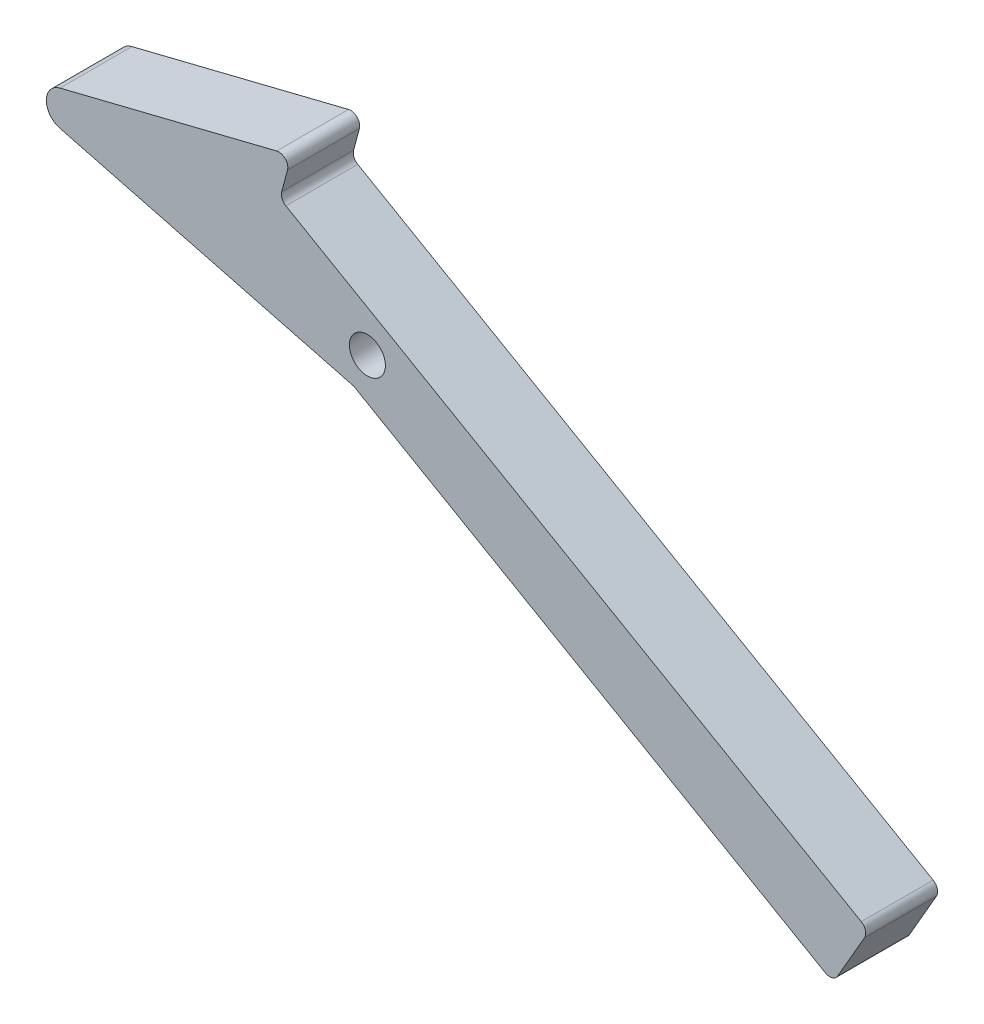
ISO-10303-21;
HEADER;
FILE_DESCRIPTION(('STEP AP214'),'2;1');
FILE_NAME('part.step','',(''),(''),'','','');
FILE_SCHEMA(('AUTOMOTIVE_DESIGN { 1 0 10303 214 1 1 1 1 }'));
ENDSEC;
DATA;
#1=APPLICATION_CONTEXT('core data for automotive mechanical design processes');
#2=APPLICATION_PROTOCOL_DEFINITION('international standard','automotive_design',2000,#1);
#3=PRODUCT_CONTEXT('',#1,'mechanical');
#4=PRODUCT('Part','Part','',(#3));
#5=PRODUCT_RELATED_PRODUCT_CATEGORY('part','',(#4));
#6=PRODUCT_DEFINITION_FORMATION('','',#4);
#7=PRODUCT_DEFINITION_CONTEXT('part definition',#1,'design');
#8=PRODUCT_DEFINITION('design','',#6,#7);
#9=PRODUCT_DEFINITION_SHAPE('','',#8);
#10=(LENGTH_UNIT() NAMED_UNIT(*) SI_UNIT(.MILLI.,.METRE.));
#11=(NAMED_UNIT(*) PLANE_ANGLE_UNIT() SI_UNIT($,.RADIAN.));
#12=(NAMED_UNIT(*) SI_UNIT($,.STERADIAN.) SOLID_ANGLE_UNIT());
#13=UNCERTAINTY_MEASURE_WITH_UNIT(LENGTH_MEASURE(1.E-05),#10,'distance_accuracy_value','');
#14=(GEOMETRIC_REPRESENTATION_CONTEXT(3) GLOBAL_UNCERTAINTY_ASSIGNED_CONTEXT((#13)) GLOBAL_UNIT_ASSIGNED_CONTEXT((#10,
#11,#12)) REPRESENTATION_CONTEXT('',''));
#15=CARTESIAN_POINT('',(0.,0.,0.));
#16=DIRECTION('',(0.,0.,1.));
#17=DIRECTION('',(1.,0.,0.));
#18=AXIS2_PLACEMENT_3D('',#15,#16,#17);
#19=CARTESIAN_POINT('',(1.58749999999999,2.7496306570156,-3.175));
#20=DIRECTION('',(-0.499999999999998,-0.86602540378444,0.));
#21=DIRECTION('',(0.86602540378444,-0.499999999999998,0.));
#22=AXIS2_PLACEMENT_3D('',#19,#20,#21);
#23=PLANE('',#22);
#24=DIRECTION('',(0.86602540378444,-0.499999999999998,0.));
#25=VECTOR('',#24,1.);
#26=CARTESIAN_POINT('',(1.58749999999999,2.7496306570156,3.175));
#27=LINE('',#26,#25);
#28=CARTESIAN_POINT('',(-7.20064251139426,7.82346710164583,3.175));
#29=VERTEX_POINT('',#28);
#30=CARTESIAN_POINT('',(43.6054846420932,-21.5094640869023,3.175));
#31=VERTEX_POINT('',#30);
#32=EDGE_CURVE('E216',#29,#31,#27,.T.);
#33=ORIENTED_EDGE('',*,*,#32,.T.);
#34=DIRECTION('',(0.,0.,1.));
#35=VECTOR('',#34,1.);
#36=CARTESIAN_POINT('',(43.6054846420932,-21.5094640869023,-3.175));
#37=LINE('',#36,#35);
#38=CARTESIAN_POINT('',(43.6054846420932,-21.5094640869023,-3.175));
#39=VERTEX_POINT('',#38);
#40=EDGE_CURVE('E199',#31,#39,#37,.F.);
#41=ORIENTED_EDGE('',*,*,#40,.T.);
#42=DIRECTION('',(0.86602540378444,-0.499999999999998,0.));
#43=VECTOR('',#42,1.);
#44=CARTESIAN_POINT('',(1.58749999999999,2.7496306570156,-3.175));
#45=LINE('',#44,#43);
#46=CARTESIAN_POINT('',(-7.20064251139426,7.82346710164583,-3.175));
#47=VERTEX_POINT('',#46);
#48=EDGE_CURVE('E164',#47,#39,#45,.T.);
#49=ORIENTED_EDGE('',*,*,#48,.F.);
#50=DIRECTION('',(0.,0.,1.));
#51=VECTOR('',#50,1.);
#52=CARTESIAN_POINT('',(-7.20064251139426,7.82346710164583,-3.175));
#53=LINE('',#52,#51);
#54=EDGE_CURVE('E196',#47,#29,#53,.T.);
#55=ORIENTED_EDGE('',*,*,#54,.T.);
#56=EDGE_LOOP('',(#33,#41,#49,#55));
#57=FACE_BOUND('',#56,.T.);
#58=ADVANCED_FACE('F41',(#57),#23,.F.);
#59=CARTESIAN_POINT('',(42.7053923063471,-24.6559697439179,-3.175));
#60=DIRECTION('',(-0.86602540378444,0.499999999999998,0.));
#61=DIRECTION('',(-0.499999999999998,-0.86602540378444,0.));
#62=AXIS2_PLACEMENT_3D('',#59,#60,#61);
#63=PLANE('',#62);
#64=DIRECTION('',(-0.499999999999998,-0.86602540378444,0.));
#65=VECTOR('',#64,1.);
#66=CARTESIAN_POINT('',(42.7053923063471,-24.6559697439179,-3.175));
#67=LINE('',#66,#65);
#68=CARTESIAN_POINT('',(43.8960173063471,-22.5937467511562,-3.175));
#69=VERTEX_POINT('',#68);
#70=CARTESIAN_POINT('',(41.5147673063471,-26.7181927366796,-3.175));
#71=VERTEX_POINT('',#70);
#72=EDGE_CURVE('E177',#69,#71,#67,.T.);
#73=ORIENTED_EDGE('',*,*,#72,.F.);
#74=DIRECTION('',(0.,0.,1.));
#75=VECTOR('',#74,1.);
#76=CARTESIAN_POINT('',(43.8960173063471,-22.5937467511562,-3.175));
#77=LINE('',#76,#75);
#78=CARTESIAN_POINT('',(43.8960173063471,-22.5937467511562,3.175));
#79=VERTEX_POINT('',#78);
#80=EDGE_CURVE('E188',#69,#79,#77,.T.);
#81=ORIENTED_EDGE('',*,*,#80,.T.);
#82=DIRECTION('',(-0.499999999999998,-0.86602540378444,0.));
#83=VECTOR('',#82,1.);
#84=CARTESIAN_POINT('',(42.7053923063471,-24.6559697439179,3.175));
#85=LINE('',#84,#83);
#86=CARTESIAN_POINT('',(41.5147673063471,-26.7181927366796,3.175));
#87=VERTEX_POINT('',#86);
#88=EDGE_CURVE('E158',#79,#87,#85,.T.);
#89=ORIENTED_EDGE('',*,*,#88,.T.);
#90=DIRECTION('',(0.,0.,1.));
#91=VECTOR('',#90,1.);
#92=CARTESIAN_POINT('',(41.5147673063471,-26.7181927366796,-3.175));
#93=LINE('',#92,#91);
#94=EDGE_CURVE('E185',#87,#71,#93,.F.);
#95=ORIENTED_EDGE('',*,*,#94,.T.);
#96=EDGE_LOOP('',(#73,#81,#89,#95));
#97=FACE_BOUND('',#96,.T.);
#98=ADVANCED_FACE('F235',(#97),#63,.F.);
#99=CARTESIAN_POINT('',(-1.58749999999999,-2.74963065701558,-3.175));
#100=DIRECTION('',(0.499999999999998,0.866025403784439,0.));
#101=DIRECTION('',(-0.86602540378444,0.499999999999998,0.));
#102=AXIS2_PLACEMENT_3D('',#99,#100,#101);
#103=PLANE('',#102);
#104=DIRECTION('',(-0.86602540378444,0.499999999999998,0.));
#105=VECTOR('',#104,1.);
#106=CARTESIAN_POINT('',(-1.58749999999999,-2.74963065701558,-3.175));
#107=LINE('',#106,#105);
#108=CARTESIAN_POINT('',(40.4304846420932,-27.0087254009335,-3.175));
#109=VERTEX_POINT('',#108);
#110=CARTESIAN_POINT('',(-1.21507831394484,-2.96464841771157,-3.175));
#111=VERTEX_POINT('',#110);
#112=EDGE_CURVE('E175',#109,#111,#107,.T.);
#113=ORIENTED_EDGE('',*,*,#112,.F.);
#114=DIRECTION('',(0.,0.,1.));
#115=VECTOR('',#114,1.);
#116=CARTESIAN_POINT('',(40.4304846420932,-27.0087254009335,-3.175));
#117=LINE('',#116,#115);
#118=CARTESIAN_POINT('',(40.4304846420932,-27.0087254009335,3.175));
#119=VERTEX_POINT('',#118);
#120=EDGE_CURVE('E206',#109,#119,#117,.T.);
#121=ORIENTED_EDGE('',*,*,#120,.T.);
#122=DIRECTION('',(-0.86602540378444,0.499999999999998,0.));
#123=VECTOR('',#122,1.);
#124=CARTESIAN_POINT('',(-1.58749999999999,-2.74963065701558,3.175));
#125=LINE('',#124,#123);
#126=CARTESIAN_POINT('',(-1.21507831394484,-2.96464841771157,3.175));
#127=VERTEX_POINT('',#126);
#128=EDGE_CURVE('E153',#119,#127,#125,.T.);
#129=ORIENTED_EDGE('',*,*,#128,.T.);
#130=DIRECTION('',(0.,0.,1.));
#131=VECTOR('',#130,1.);
#132=CARTESIAN_POINT('',(-1.21507831394484,-2.96464841771157,-3.175));
#133=LINE('',#132,#131);
#134=EDGE_CURVE('E182',#111,#127,#133,.T.);
#135=ORIENTED_EDGE('',*,*,#134,.F.);
#136=EDGE_LOOP('',(#113,#121,#129,#135));
#137=FACE_BOUND('',#136,.T.);
#138=ADVANCED_FACE('F244',(#137),#103,.F.);
#139=CARTESIAN_POINT('',(-0.79887816906418,-3.07285187911696,-3.175));
#140=DIRECTION('',(-0.251615171358797,-0.967827363501406,0.));
#141=DIRECTION('',(0.967827363501406,-0.251615171358797,0.));
#142=AXIS2_PLACEMENT_3D('',#139,#140,#141);
#143=PLANE('',#142);
#144=ORIENTED_EDGE('',*,*,#134,.T.);
#145=DIRECTION('',(0.967827363501406,-0.251615171358797,0.));
#146=VECTOR('',#145,1.);
#147=CARTESIAN_POINT('',(-0.79887816906418,-3.07285187911696,3.175));
#148=LINE('',#147,#146);
#149=CARTESIAN_POINT('',(-27.1617476790787,3.7809509574488,3.175));
#150=VERTEX_POINT('',#149);
#151=EDGE_CURVE('E151',#150,#127,#148,.T.);
#152=ORIENTED_EDGE('',*,*,#151,.F.);
#153=DIRECTION('',(0.,0.,1.));
#154=VECTOR('',#153,1.);
#155=CARTESIAN_POINT('',(-27.1617476790787,3.7809509574488,-3.175));
#156=LINE('',#155,#154);
#157=CARTESIAN_POINT('',(-27.1617476790787,3.7809509574488,-3.175));
#158=VERTEX_POINT('',#157);
#159=EDGE_CURVE('E147',#158,#150,#156,.T.);
#160=ORIENTED_EDGE('',*,*,#159,.F.);
#161=DIRECTION('',(0.967827363501406,-0.251615171358797,0.));
#162=VECTOR('',#161,1.);
#163=CARTESIAN_POINT('',(-0.79887816906418,-3.07285187911696,-3.175));
#164=LINE('',#163,#162);
#165=EDGE_CURVE('E172',#158,#111,#164,.T.);
#166=ORIENTED_EDGE('',*,*,#165,.T.);
#167=EDGE_LOOP('',(#144,#152,#160,#166));
#168=FACE_BOUND('',#167,.T.);
#169=ADVANCED_FACE('F247',(#168),#143,.T.);
#170=CARTESIAN_POINT('',(-26.7623085945466,5.31737689700728,-3.175));
#171=DIRECTION('',(0.,0.,1.));
#172=DIRECTION('',(1.,0.,0.));
#173=AXIS2_PLACEMENT_3D('',#170,#171,#172);
#174=CYLINDRICAL_SURFACE('',#173,1.5875);
#175=ORIENTED_EDGE('',*,*,#159,.T.);
#176=CARTESIAN_POINT('',(-26.7623085945466,5.31737689700728,3.175));
#177=DIRECTION('',(0.,0.,1.));
#178=DIRECTION('',(1.,0.,0.));
#179=AXIS2_PLACEMENT_3D('',#176,#177,#178);
#180=CIRCLE('',#179,1.5875);
#181=CARTESIAN_POINT('',(-27.1452403176058,6.858,3.175));
#182=VERTEX_POINT('',#181);
#183=EDGE_CURVE('E132',#182,#150,#180,.T.);
#184=ORIENTED_EDGE('',*,*,#183,.F.);
#185=DIRECTION('',(0.,0.,1.));
#186=VECTOR('',#185,1.);
#187=CARTESIAN_POINT('',(-27.1452403176058,6.858,-3.175));
#188=LINE('',#187,#186);
#189=CARTESIAN_POINT('',(-27.1452403176058,6.858,-3.175));
#190=VERTEX_POINT('',#189);
#191=EDGE_CURVE('E141',#190,#182,#188,.T.);
#192=ORIENTED_EDGE('',*,*,#191,.F.);
#193=CARTESIAN_POINT('',(-26.7623085945466,5.31737689700728,-3.175));
#194=DIRECTION('',(0.,0.,1.));
#195=DIRECTION('',(1.,0.,0.));
#196=AXIS2_PLACEMENT_3D('',#193,#194,#195);
#197=CIRCLE('',#196,1.5875);
#198=EDGE_CURVE('E170',#190,#158,#197,.T.);
#199=ORIENTED_EDGE('',*,*,#198,.T.);
#200=EDGE_LOOP('',(#175,#184,#192,#199));
#201=FACE_BOUND('',#200,.T.);
#202=ADVANCED_FACE('F150',(#201),#174,.T.);
#203=CARTESIAN_POINT('',(-3.18487768699857,12.8135013354261,-3.175));
#204=DIRECTION('',(-0.241216833423114,0.970471245979666,0.));
#205=DIRECTION('',(-0.970471245979666,-0.241216833423114,0.));
#206=AXIS2_PLACEMENT_3D('',#203,#204,#205);
#207=PLANE('',#206);
#208=DIRECTION('',(-0.970471245979666,-0.241216833423114,0.));
#209=VECTOR('',#208,1.);
#210=CARTESIAN_POINT('',(-3.18487768699857,12.8135013354261,3.175));
#211=LINE('',#210,#209);
#212=CARTESIAN_POINT('',(-8.01386633941935,11.6132253291059,3.175));
#213=VERTEX_POINT('',#212);
#214=EDGE_CURVE('E125',#213,#182,#211,.T.);
#215=ORIENTED_EDGE('',*,*,#214,.F.);
#216=DIRECTION('',(0.,0.,1.));
#217=VECTOR('',#216,1.);
#218=CARTESIAN_POINT('',(-8.01386633941935,11.6132253291059,-3.175));
#219=LINE('',#218,#217);
#220=CARTESIAN_POINT('',(-8.01386633941935,11.6132253291059,-3.175));
#221=VERTEX_POINT('',#220);
#222=EDGE_CURVE('E213',#213,#221,#219,.F.);
#223=ORIENTED_EDGE('',*,*,#222,.T.);
#224=DIRECTION('',(-0.970471245979666,-0.241216833423114,0.));
#225=VECTOR('',#224,1.);
#226=CARTESIAN_POINT('',(-3.18487768699857,12.8135013354261,-3.175));
#227=LINE('',#226,#225);
#228=EDGE_CURVE('E143',#221,#190,#227,.T.);
#229=ORIENTED_EDGE('',*,*,#228,.T.);
#230=ORIENTED_EDGE('',*,*,#191,.T.);
#231=EDGE_LOOP('',(#215,#223,#229,#230));
#232=FACE_BOUND('',#231,.T.);
#233=ADVANCED_FACE('F142',(#232),#207,.T.);
#234=CARTESIAN_POINT('',(-9.24242382494432,2.47649999999995,-3.175));
#235=DIRECTION('',(0.965925826289069,-0.258819045102516,0.));
#236=DIRECTION('',(0.258819045102516,0.96592582628907,0.));
#237=AXIS2_PLACEMENT_3D('',#234,#235,#236);
#238=PLANE('',#237);
#239=DIRECTION('',(0.258819045102516,0.96592582628907,0.));
#240=VECTOR('',#239,1.);
#241=CARTESIAN_POINT('',(-9.24242382494432,2.47649999999995,3.175));
#242=LINE('',#241,#240);
#243=CARTESIAN_POINT('',(-7.5704711360112,8.71631238294985,3.175));
#244=VERTEX_POINT('',#243);
#245=CARTESIAN_POINT('',(-7.0556968532728,10.6374761605594,3.175));
#246=VERTEX_POINT('',#245);
#247=EDGE_CURVE('E138',#244,#246,#242,.T.);
#248=ORIENTED_EDGE('',*,*,#247,.F.);
#249=DIRECTION('',(0.,0.,1.));
#250=VECTOR('',#249,1.);
#251=CARTESIAN_POINT('',(-7.5704711360112,8.71631238294985,-3.175));
#252=LINE('',#251,#250);
#253=CARTESIAN_POINT('',(-7.5704711360112,8.71631238294985,-3.175));
#254=VERTEX_POINT('',#253);
#255=EDGE_CURVE('E63',#244,#254,#252,.F.);
#256=ORIENTED_EDGE('',*,*,#255,.T.);
#257=DIRECTION('',(0.258819045102516,0.96592582628907,0.));
#258=VECTOR('',#257,1.);
#259=CARTESIAN_POINT('',(-9.24242382494432,2.47649999999995,-3.175));
#260=LINE('',#259,#258);
#261=CARTESIAN_POINT('',(-7.0556968532728,10.6374761605594,-3.175));
#262=VERTEX_POINT('',#261);
#263=EDGE_CURVE('E167',#254,#262,#260,.T.);
#264=ORIENTED_EDGE('',*,*,#263,.T.);
#265=DIRECTION('',(0.,0.,1.));
#266=VECTOR('',#265,1.);
#267=CARTESIAN_POINT('',(-7.0556968532728,10.6374761605594,-3.175));
#268=LINE('',#267,#266);
#269=EDGE_CURVE('E209',#262,#246,#268,.T.);
#270=ORIENTED_EDGE('',*,*,#269,.T.);
#271=EDGE_LOOP('',(#248,#256,#264,#270));
#272=FACE_BOUND('',#271,.T.);
#273=ADVANCED_FACE('F219',(#272),#238,.T.);
#274=CARTESIAN_POINT('',(0.,0.,-3.175));
#275=DIRECTION('',(0.,0.,1.));
#276=DIRECTION('',(1.,0.,0.));
#277=AXIS2_PLACEMENT_3D('',#274,#275,#276);
#278=CYLINDRICAL_SURFACE('',#277,1.5875);
#279=CARTESIAN_POINT('',(0.,0.,-3.175));
#280=DIRECTION('',(0.,0.,1.));
#281=DIRECTION('',(1.,0.,0.));
#282=AXIS2_PLACEMENT_3D('',#279,#280,#281);
#283=CIRCLE('',#282,1.5875);
#284=CARTESIAN_POINT('',(1.5875,0.,-3.175));
#285=VERTEX_POINT('',#284);
#286=EDGE_CURVE('E148',#285,#285,#283,.T.);
#287=ORIENTED_EDGE('',*,*,#286,.F.);
#288=EDGE_LOOP('',(#287));
#289=FACE_BOUND('',#288,.T.);
#290=CARTESIAN_POINT('',(0.,0.,3.175));
#291=DIRECTION('',(0.,0.,1.));
#292=DIRECTION('',(1.,0.,0.));
#293=AXIS2_PLACEMENT_3D('',#290,#291,#292);
#294=CIRCLE('',#293,1.5875);
#295=CARTESIAN_POINT('',(1.5875,0.,3.175));
#296=VERTEX_POINT('',#295);
#297=EDGE_CURVE('E161',#296,#296,#294,.T.);
#298=ORIENTED_EDGE('',*,*,#297,.T.);
#299=EDGE_LOOP('',(#298));
#300=FACE_BOUND('',#299,.T.);
#301=ADVANCED_FACE('F303',(#289,#300),#278,.F.);
#302=CARTESIAN_POINT('',(0.,0.,-3.175));
#303=DIRECTION('',(0.,0.,1.));
#304=DIRECTION('',(1.,0.,0.));
#305=AXIS2_PLACEMENT_3D('',#302,#303,#304);
#306=PLANE('',#305);
#307=ORIENTED_EDGE('',*,*,#48,.T.);
#308=CARTESIAN_POINT('',(43.2086096420932,-22.1968717511562,-3.175));
#309=DIRECTION('',(0.,0.,1.));
#310=DIRECTION('',(1.,0.,0.));
#311=AXIS2_PLACEMENT_3D('',#308,#309,#310);
#312=CIRCLE('',#311,0.79375);
#313=EDGE_CURVE('E204',#39,#69,#312,.F.);
#314=ORIENTED_EDGE('',*,*,#313,.T.);
#315=ORIENTED_EDGE('',*,*,#72,.T.);
#316=CARTESIAN_POINT('',(40.8273596420932,-26.3213177366796,-3.175));
#317=DIRECTION('',(0.,0.,1.));
#318=DIRECTION('',(1.,0.,0.));
#319=AXIS2_PLACEMENT_3D('',#316,#317,#318);
#320=CIRCLE('',#319,0.79375);
#321=EDGE_CURVE('E202',#71,#109,#320,.F.);
#322=ORIENTED_EDGE('',*,*,#321,.T.);
#323=ORIENTED_EDGE('',*,*,#112,.T.);
#324=ORIENTED_EDGE('',*,*,#165,.F.);
#325=ORIENTED_EDGE('',*,*,#198,.F.);
#326=ORIENTED_EDGE('',*,*,#228,.F.);
#327=CARTESIAN_POINT('',(-7.82240047788975,10.8429137776096,-3.175));
#328=DIRECTION('',(0.,0.,1.));
#329=DIRECTION('',(1.,0.,0.));
#330=AXIS2_PLACEMENT_3D('',#327,#328,#329);
#331=CIRCLE('',#330,0.79375);
#332=EDGE_CURVE('E56',#221,#262,#331,.F.);
#333=ORIENTED_EDGE('',*,*,#332,.T.);
#334=ORIENTED_EDGE('',*,*,#263,.F.);
#335=CARTESIAN_POINT('',(-6.80376751139426,8.51087476589973,-3.175));
#336=DIRECTION('',(0.,0.,1.));
#337=DIRECTION('',(1.,0.,0.));
#338=AXIS2_PLACEMENT_3D('',#335,#336,#337);
#339=CIRCLE('',#338,0.79375);
#340=EDGE_CURVE('E11',#254,#47,#339,.T.);
#341=ORIENTED_EDGE('',*,*,#340,.T.);
#342=EDGE_LOOP('',(#307,#314,#315,#322,#323,#324,#325,#326,#333,#334,#341));
#343=FACE_BOUND('',#342,.T.);
#344=ORIENTED_EDGE('',*,*,#286,.T.);
#345=EDGE_LOOP('',(#344));
#346=FACE_BOUND('',#345,.T.);
#347=ADVANCED_FACE('F224',(#343,#346),#306,.F.);
#348=CARTESIAN_POINT('',(0.,0.,3.175));
#349=DIRECTION('',(0.,0.,1.));
#350=DIRECTION('',(1.,0.,0.));
#351=AXIS2_PLACEMENT_3D('',#348,#349,#350);
#352=PLANE('',#351);
#353=ORIENTED_EDGE('',*,*,#88,.F.);
#354=CARTESIAN_POINT('',(43.2086096420932,-22.1968717511562,3.175));
#355=DIRECTION('',(0.,0.,1.));
#356=DIRECTION('',(1.,0.,0.));
#357=AXIS2_PLACEMENT_3D('',#354,#355,#356);
#358=CIRCLE('',#357,0.79375);
#359=EDGE_CURVE('E194',#79,#31,#358,.T.);
#360=ORIENTED_EDGE('',*,*,#359,.T.);
#361=ORIENTED_EDGE('',*,*,#32,.F.);
#362=CARTESIAN_POINT('',(-6.80376751139426,8.51087476589973,3.175));
#363=DIRECTION('',(0.,0.,1.));
#364=DIRECTION('',(1.,0.,0.));
#365=AXIS2_PLACEMENT_3D('',#362,#363,#364);
#366=CIRCLE('',#365,0.79375);
#367=EDGE_CURVE('E49',#29,#244,#366,.F.);
#368=ORIENTED_EDGE('',*,*,#367,.T.);
#369=ORIENTED_EDGE('',*,*,#247,.T.);
#370=CARTESIAN_POINT('',(-7.82240047788975,10.8429137776096,3.175));
#371=DIRECTION('',(0.,0.,1.));
#372=DIRECTION('',(1.,0.,0.));
#373=AXIS2_PLACEMENT_3D('',#370,#371,#372);
#374=CIRCLE('',#373,0.79375);
#375=EDGE_CURVE('E135',#246,#213,#374,.T.);
#376=ORIENTED_EDGE('',*,*,#375,.T.);
#377=ORIENTED_EDGE('',*,*,#214,.T.);
#378=ORIENTED_EDGE('',*,*,#183,.T.);
#379=ORIENTED_EDGE('',*,*,#151,.T.);
#380=ORIENTED_EDGE('',*,*,#128,.F.);
#381=CARTESIAN_POINT('',(40.8273596420932,-26.3213177366796,3.175));
#382=DIRECTION('',(0.,0.,1.));
#383=DIRECTION('',(1.,0.,0.));
#384=AXIS2_PLACEMENT_3D('',#381,#382,#383);
#385=CIRCLE('',#384,0.79375);
#386=EDGE_CURVE('E192',#119,#87,#385,.T.);
#387=ORIENTED_EDGE('',*,*,#386,.T.);
#388=EDGE_LOOP('',(#353,#360,#361,#368,#369,#376,#377,#378,#379,#380,#387));
#389=FACE_BOUND('',#388,.T.);
#390=ORIENTED_EDGE('',*,*,#297,.F.);
#391=EDGE_LOOP('',(#390));
#392=FACE_BOUND('',#391,.T.);
#393=ADVANCED_FACE('F128',(#389,#392),#352,.T.);
#394=CARTESIAN_POINT('',(43.2086096420932,-22.1968717511562,-3.175));
#395=DIRECTION('',(0.,0.,1.));
#396=DIRECTION('',(1.,0.,0.));
#397=AXIS2_PLACEMENT_3D('',#394,#395,#396);
#398=CYLINDRICAL_SURFACE('',#397,0.79375);
#399=ORIENTED_EDGE('',*,*,#313,.F.);
#400=ORIENTED_EDGE('',*,*,#40,.F.);
#401=ORIENTED_EDGE('',*,*,#359,.F.);
#402=ORIENTED_EDGE('',*,*,#80,.F.);
#403=EDGE_LOOP('',(#399,#400,#401,#402));
#404=FACE_BOUND('',#403,.T.);
#405=ADVANCED_FACE('F230',(#404),#398,.T.);
#406=CARTESIAN_POINT('',(40.8273596420932,-26.3213177366796,-3.175));
#407=DIRECTION('',(0.,0.,1.));
#408=DIRECTION('',(1.,0.,0.));
#409=AXIS2_PLACEMENT_3D('',#406,#407,#408);
#410=CYLINDRICAL_SURFACE('',#409,0.79375);
#411=ORIENTED_EDGE('',*,*,#321,.F.);
#412=ORIENTED_EDGE('',*,*,#94,.F.);
#413=ORIENTED_EDGE('',*,*,#386,.F.);
#414=ORIENTED_EDGE('',*,*,#120,.F.);
#415=EDGE_LOOP('',(#411,#412,#413,#414));
#416=FACE_BOUND('',#415,.T.);
#417=ADVANCED_FACE('F238',(#416),#410,.T.);
#418=CARTESIAN_POINT('',(-6.80376751139426,8.51087476589973,-3.175));
#419=DIRECTION('',(0.,0.,1.));
#420=DIRECTION('',(1.,0.,0.));
#421=AXIS2_PLACEMENT_3D('',#418,#419,#420);
#422=CYLINDRICAL_SURFACE('',#421,0.79375);
#423=ORIENTED_EDGE('',*,*,#340,.F.);
#424=ORIENTED_EDGE('',*,*,#255,.F.);
#425=ORIENTED_EDGE('',*,*,#367,.F.);
#426=ORIENTED_EDGE('',*,*,#54,.F.);
#427=EDGE_LOOP('',(#423,#424,#425,#426));
#428=FACE_BOUND('',#427,.T.);
#429=ADVANCED_FACE('F222',(#428),#422,.F.);
#430=CARTESIAN_POINT('',(-7.82240047788975,10.8429137776096,-3.175));
#431=DIRECTION('',(0.,0.,1.));
#432=DIRECTION('',(1.,0.,0.));
#433=AXIS2_PLACEMENT_3D('',#430,#431,#432);
#434=CYLINDRICAL_SURFACE('',#433,0.79375);
#435=ORIENTED_EDGE('',*,*,#332,.F.);
#436=ORIENTED_EDGE('',*,*,#222,.F.);
#437=ORIENTED_EDGE('',*,*,#375,.F.);
#438=ORIENTED_EDGE('',*,*,#269,.F.);
#439=EDGE_LOOP('',(#435,#436,#437,#438));
#440=FACE_BOUND('',#439,.T.);
#441=ADVANCED_FACE('F43',(#440),#434,.T.);
#442=CLOSED_SHELL('',(#58,#98,#138,#169,#202,#233,#273,#301,#347,#393,#405,#417,#429,#441));
#443=MANIFOLD_SOLID_BREP('B2',#442);
#444=ADVANCED_BREP_SHAPE_REPRESENTATION('',(#18,#443),#14);
#445=SHAPE_DEFINITION_REPRESENTATION(#9,#444);
ENDSEC;
END-ISO-10303-21;
